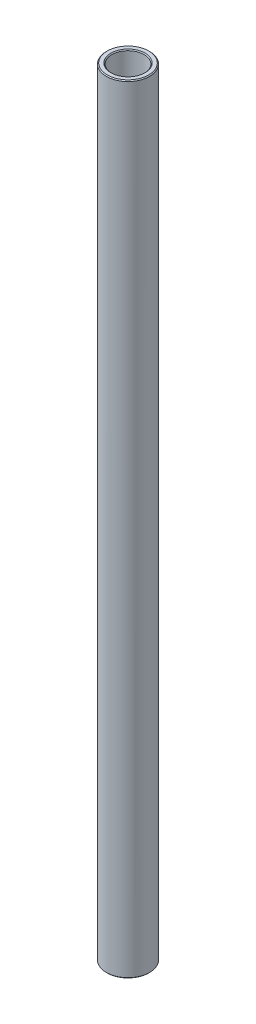
ISO-10303-21;
HEADER;
FILE_DESCRIPTION(('STEP AP214'),'2;1');
FILE_NAME('part.step','',(''),(''),'','','');
FILE_SCHEMA(('AUTOMOTIVE_DESIGN { 1 0 10303 214 1 1 1 1 }'));
ENDSEC;
DATA;
#1=APPLICATION_CONTEXT('core data for automotive mechanical design processes');
#2=APPLICATION_PROTOCOL_DEFINITION('international standard','automotive_design',2000,#1);
#3=PRODUCT_CONTEXT('',#1,'mechanical');
#4=PRODUCT('Part','Part','',(#3));
#5=PRODUCT_RELATED_PRODUCT_CATEGORY('part','',(#4));
#6=PRODUCT_DEFINITION_FORMATION('','',#4);
#7=PRODUCT_DEFINITION_CONTEXT('part definition',#1,'design');
#8=PRODUCT_DEFINITION('design','',#6,#7);
#9=PRODUCT_DEFINITION_SHAPE('','',#8);
#10=(LENGTH_UNIT() NAMED_UNIT(*) SI_UNIT(.MILLI.,.METRE.));
#11=(NAMED_UNIT(*) PLANE_ANGLE_UNIT() SI_UNIT($,.RADIAN.));
#12=(NAMED_UNIT(*) SI_UNIT($,.STERADIAN.) SOLID_ANGLE_UNIT());
#13=UNCERTAINTY_MEASURE_WITH_UNIT(LENGTH_MEASURE(1.E-05),#10,'distance_accuracy_value','');
#14=(GEOMETRIC_REPRESENTATION_CONTEXT(3) GLOBAL_UNCERTAINTY_ASSIGNED_CONTEXT((#13)) GLOBAL_UNIT_ASSIGNED_CONTEXT((#10,
#11,#12)) REPRESENTATION_CONTEXT('',''));
#15=CARTESIAN_POINT('',(0.,0.,0.));
#16=DIRECTION('',(0.,0.,1.));
#17=DIRECTION('',(1.,0.,0.));
#18=AXIS2_PLACEMENT_3D('',#15,#16,#17);
#19=CARTESIAN_POINT('',(0.,11.60859375,0.));
#20=DIRECTION('',(0.,1.,0.));
#21=DIRECTION('',(-1.,0.,0.));
#22=AXIS2_PLACEMENT_3D('',#19,#20,#21);
#23=CYLINDRICAL_SURFACE('',#22,4.7625);
#24=CARTESIAN_POINT('',(0.,-114.046,0.));
#25=DIRECTION('',(0.,1.,0.));
#26=DIRECTION('',(-1.,0.,0.));
#27=AXIS2_PLACEMENT_3D('',#24,#25,#26);
#28=CIRCLE('',#27,4.7625);
#29=CARTESIAN_POINT('',(-4.76250000000001,-114.046,0.));
#30=VERTEX_POINT('',#29);
#31=EDGE_CURVE('E57',#30,#30,#28,.F.);
#32=ORIENTED_EDGE('',*,*,#31,.T.);
#33=EDGE_LOOP('',(#32));
#34=FACE_BOUND('',#33,.T.);
#35=CARTESIAN_POINT('',(0.,114.046,0.));
#36=DIRECTION('',(0.,-1.,0.));
#37=DIRECTION('',(1.,0.,0.));
#38=AXIS2_PLACEMENT_3D('',#35,#36,#37);
#39=CIRCLE('',#38,4.7625);
#40=CARTESIAN_POINT('',(4.76250000000001,114.046,0.));
#41=VERTEX_POINT('',#40);
#42=EDGE_CURVE('E60',#41,#41,#39,.F.);
#43=ORIENTED_EDGE('',*,*,#42,.T.);
#44=EDGE_LOOP('',(#43));
#45=FACE_BOUND('',#44,.T.);
#46=ADVANCED_FACE('F37',(#34,#45),#23,.F.);
#47=CARTESIAN_POINT('',(4.76249999999998,114.3,0.));
#48=DIRECTION('',(0.,-1.,0.));
#49=DIRECTION('',(1.,0.,0.));
#50=AXIS2_PLACEMENT_3D('',#47,#48,#49);
#51=PLANE('',#50);
#52=CARTESIAN_POINT('',(0.,114.3,0.));
#53=DIRECTION('',(0.,-1.,0.));
#54=DIRECTION('',(1.,0.,0.));
#55=AXIS2_PLACEMENT_3D('',#52,#53,#54);
#56=CIRCLE('',#55,6.09599999999999);
#57=CARTESIAN_POINT('',(6.096,114.3,0.));
#58=VERTEX_POINT('',#57);
#59=EDGE_CURVE('E10',#58,#58,#56,.F.);
#60=ORIENTED_EDGE('',*,*,#59,.T.);
#61=EDGE_LOOP('',(#60));
#62=FACE_BOUND('',#61,.T.);
#63=CARTESIAN_POINT('',(0.,114.3,0.));
#64=DIRECTION('',(0.,-1.,0.));
#65=DIRECTION('',(1.,0.,0.));
#66=AXIS2_PLACEMENT_3D('',#63,#64,#65);
#67=CIRCLE('',#66,5.01649999999998);
#68=CARTESIAN_POINT('',(5.0165,114.3,0.));
#69=VERTEX_POINT('',#68);
#70=EDGE_CURVE('E44',#69,#69,#67,.T.);
#71=ORIENTED_EDGE('',*,*,#70,.T.);
#72=EDGE_LOOP('',(#71));
#73=FACE_BOUND('',#72,.T.);
#74=ADVANCED_FACE('F83',(#62,#73),#51,.F.);
#75=CARTESIAN_POINT('',(0.,11.60859375,0.));
#76=DIRECTION('',(0.,1.,0.));
#77=DIRECTION('',(-1.,0.,0.));
#78=AXIS2_PLACEMENT_3D('',#75,#76,#77);
#79=CYLINDRICAL_SURFACE('',#78,6.35);
#80=CARTESIAN_POINT('',(0.,-114.046,0.));
#81=DIRECTION('',(0.,1.,0.));
#82=DIRECTION('',(-1.,0.,0.));
#83=AXIS2_PLACEMENT_3D('',#80,#81,#82);
#84=CIRCLE('',#83,6.35);
#85=CARTESIAN_POINT('',(-6.35000000000001,-114.046,0.));
#86=VERTEX_POINT('',#85);
#87=EDGE_CURVE('E48',#86,#86,#84,.T.);
#88=ORIENTED_EDGE('',*,*,#87,.T.);
#89=EDGE_LOOP('',(#88));
#90=FACE_BOUND('',#89,.T.);
#91=CARTESIAN_POINT('',(0.,114.046,0.));
#92=DIRECTION('',(0.,-1.,0.));
#93=DIRECTION('',(1.,0.,0.));
#94=AXIS2_PLACEMENT_3D('',#91,#92,#93);
#95=CIRCLE('',#94,6.35);
#96=CARTESIAN_POINT('',(6.35000000000002,114.046,0.));
#97=VERTEX_POINT('',#96);
#98=EDGE_CURVE('E52',#97,#97,#95,.T.);
#99=ORIENTED_EDGE('',*,*,#98,.T.);
#100=EDGE_LOOP('',(#99));
#101=FACE_BOUND('',#100,.T.);
#102=ADVANCED_FACE('F80',(#90,#101),#79,.T.);
#103=CARTESIAN_POINT('',(6.35000000000002,-114.3,0.));
#104=DIRECTION('',(0.,1.,0.));
#105=DIRECTION('',(-1.,0.,0.));
#106=AXIS2_PLACEMENT_3D('',#103,#104,#105);
#107=PLANE('',#106);
#108=CARTESIAN_POINT('',(0.,-114.3,0.));
#109=DIRECTION('',(0.,1.,0.));
#110=DIRECTION('',(-1.,0.,0.));
#111=AXIS2_PLACEMENT_3D('',#108,#109,#110);
#112=CIRCLE('',#111,5.01650000000003);
#113=CARTESIAN_POINT('',(-5.01650000000005,-114.3,0.));
#114=VERTEX_POINT('',#113);
#115=EDGE_CURVE('E63',#114,#114,#112,.T.);
#116=ORIENTED_EDGE('',*,*,#115,.T.);
#117=EDGE_LOOP('',(#116));
#118=FACE_BOUND('',#117,.T.);
#119=CARTESIAN_POINT('',(0.,-114.3,0.));
#120=DIRECTION('',(0.,1.,0.));
#121=DIRECTION('',(-1.,0.,0.));
#122=AXIS2_PLACEMENT_3D('',#119,#120,#121);
#123=CIRCLE('',#122,6.09599999999999);
#124=CARTESIAN_POINT('',(-6.096,-114.3,0.));
#125=VERTEX_POINT('',#124);
#126=EDGE_CURVE('E66',#125,#125,#123,.F.);
#127=ORIENTED_EDGE('',*,*,#126,.T.);
#128=EDGE_LOOP('',(#127));
#129=FACE_BOUND('',#128,.T.);
#130=ADVANCED_FACE('F70',(#118,#129),#107,.F.);
#131=CARTESIAN_POINT('',(0.,-114.3,0.));
#132=DIRECTION('',(0.,-1.,0.));
#133=DIRECTION('',(1.,0.,0.));
#134=AXIS2_PLACEMENT_3D('',#131,#132,#133);
#135=CONICAL_SURFACE('',#134,5.01650000000003,0.785398163397515);
#136=ORIENTED_EDGE('',*,*,#31,.F.);
#137=EDGE_LOOP('',(#136));
#138=FACE_BOUND('',#137,.T.);
#139=ORIENTED_EDGE('',*,*,#115,.F.);
#140=EDGE_LOOP('',(#139));
#141=FACE_BOUND('',#140,.T.);
#142=ADVANCED_FACE('F76',(#138,#141),#135,.F.);
#143=CARTESIAN_POINT('',(0.,-114.046,0.));
#144=DIRECTION('',(0.,1.,0.));
#145=DIRECTION('',(-1.,0.,0.));
#146=AXIS2_PLACEMENT_3D('',#143,#144,#145);
#147=CONICAL_SURFACE('',#146,6.35,0.785398163397406);
#148=ORIENTED_EDGE('',*,*,#126,.F.);
#149=EDGE_LOOP('',(#148));
#150=FACE_BOUND('',#149,.T.);
#151=ORIENTED_EDGE('',*,*,#87,.F.);
#152=EDGE_LOOP('',(#151));
#153=FACE_BOUND('',#152,.T.);
#154=ADVANCED_FACE('F72',(#150,#153),#147,.T.);
#155=CARTESIAN_POINT('',(0.,114.3,0.));
#156=DIRECTION('',(0.,-1.,0.));
#157=DIRECTION('',(1.,0.,0.));
#158=AXIS2_PLACEMENT_3D('',#155,#156,#157);
#159=CONICAL_SURFACE('',#158,6.09599999999999,0.78539816339746);
#160=ORIENTED_EDGE('',*,*,#98,.F.);
#161=EDGE_LOOP('',(#160));
#162=FACE_BOUND('',#161,.T.);
#163=ORIENTED_EDGE('',*,*,#59,.F.);
#164=EDGE_LOOP('',(#163));
#165=FACE_BOUND('',#164,.T.);
#166=ADVANCED_FACE('F75',(#162,#165),#159,.T.);
#167=CARTESIAN_POINT('',(0.,114.046,0.));
#168=DIRECTION('',(0.,1.,0.));
#169=DIRECTION('',(-1.,0.,0.));
#170=AXIS2_PLACEMENT_3D('',#167,#168,#169);
#171=CONICAL_SURFACE('',#170,4.7625,0.785398163397433);
#172=ORIENTED_EDGE('',*,*,#70,.F.);
#173=EDGE_LOOP('',(#172));
#174=FACE_BOUND('',#173,.T.);
#175=ORIENTED_EDGE('',*,*,#42,.F.);
#176=EDGE_LOOP('',(#175));
#177=FACE_BOUND('',#176,.T.);
#178=ADVANCED_FACE('F39',(#174,#177),#171,.F.);
#179=CLOSED_SHELL('',(#46,#74,#102,#130,#142,#154,#166,#178));
#180=MANIFOLD_SOLID_BREP('B2',#179);
#181=ADVANCED_BREP_SHAPE_REPRESENTATION('',(#18,#180),#14);
#182=SHAPE_DEFINITION_REPRESENTATION(#9,#181);
ENDSEC;
END-ISO-10303-21;
